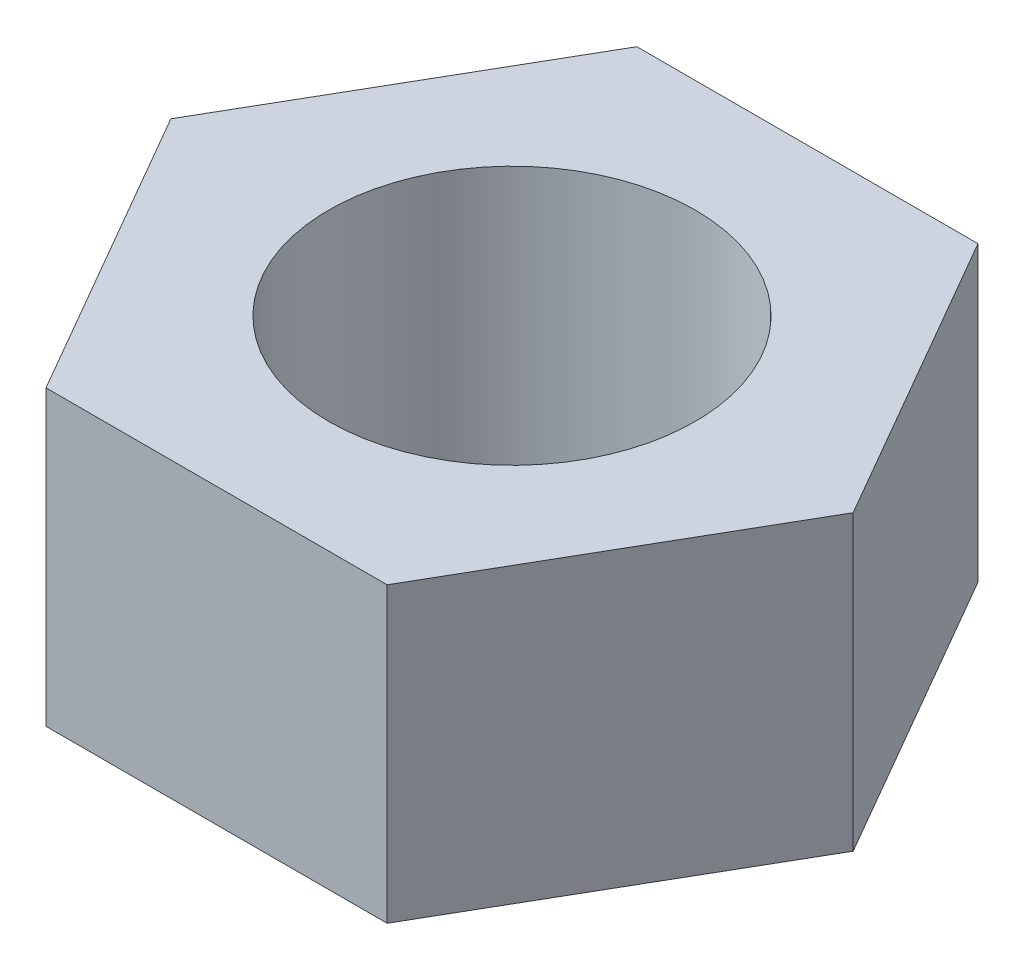
ISO-10303-21;
HEADER;
FILE_DESCRIPTION(('STEP AP214'),'2;1');
FILE_NAME('part.step','',(''),(''),'','','');
FILE_SCHEMA(('AUTOMOTIVE_DESIGN { 1 0 10303 214 1 1 1 1 }'));
ENDSEC;
DATA;
#1=APPLICATION_CONTEXT('core data for automotive mechanical design processes');
#2=APPLICATION_PROTOCOL_DEFINITION('international standard','automotive_design',2000,#1);
#3=PRODUCT_CONTEXT('',#1,'mechanical');
#4=PRODUCT('Part','Part','',(#3));
#5=PRODUCT_RELATED_PRODUCT_CATEGORY('part','',(#4));
#6=PRODUCT_DEFINITION_FORMATION('','',#4);
#7=PRODUCT_DEFINITION_CONTEXT('part definition',#1,'design');
#8=PRODUCT_DEFINITION('design','',#6,#7);
#9=PRODUCT_DEFINITION_SHAPE('','',#8);
#10=(LENGTH_UNIT() NAMED_UNIT(*) SI_UNIT(.MILLI.,.METRE.));
#11=(NAMED_UNIT(*) PLANE_ANGLE_UNIT() SI_UNIT($,.RADIAN.));
#12=(NAMED_UNIT(*) SI_UNIT($,.STERADIAN.) SOLID_ANGLE_UNIT());
#13=UNCERTAINTY_MEASURE_WITH_UNIT(LENGTH_MEASURE(1.E-05),#10,'distance_accuracy_value','');
#14=(GEOMETRIC_REPRESENTATION_CONTEXT(3) GLOBAL_UNCERTAINTY_ASSIGNED_CONTEXT((#13)) GLOBAL_UNIT_ASSIGNED_CONTEXT((#10,
#11,#12)) REPRESENTATION_CONTEXT('',''));
#15=CARTESIAN_POINT('',(0.,0.,0.));
#16=DIRECTION('',(0.,0.,1.));
#17=DIRECTION('',(1.,0.,0.));
#18=AXIS2_PLACEMENT_3D('',#15,#16,#17);
#19=CARTESIAN_POINT('',(0.,6.4,0.));
#20=DIRECTION('',(0.,1.,0.));
#21=DIRECTION('',(0.,0.,1.));
#22=AXIS2_PLACEMENT_3D('',#19,#20,#21);
#23=PLANE('',#22);
#24=DIRECTION('',(-0.5,0.,-0.866025403784439));
#25=VECTOR('',#24,1.);
#26=CARTESIAN_POINT('',(7.44781847254618,6.4,0.));
#27=LINE('',#26,#25);
#28=CARTESIAN_POINT('',(7.44781847254618,6.4,0.));
#29=VERTEX_POINT('',#28);
#30=CARTESIAN_POINT('',(3.72390923627309,6.4,-6.45));
#31=VERTEX_POINT('',#30);
#32=EDGE_CURVE('E146',#29,#31,#27,.T.);
#33=ORIENTED_EDGE('',*,*,#32,.T.);
#34=DIRECTION('',(-1.,0.,0.));
#35=VECTOR('',#34,1.);
#36=CARTESIAN_POINT('',(3.72390923627309,6.4,-6.45));
#37=LINE('',#36,#35);
#38=CARTESIAN_POINT('',(-3.72390923627309,6.4,-6.45));
#39=VERTEX_POINT('',#38);
#40=EDGE_CURVE('E94',#31,#39,#37,.T.);
#41=ORIENTED_EDGE('',*,*,#40,.T.);
#42=DIRECTION('',(-0.5,0.,0.866025403784439));
#43=VECTOR('',#42,1.);
#44=CARTESIAN_POINT('',(-3.72390923627309,6.4,-6.45));
#45=LINE('',#44,#43);
#46=CARTESIAN_POINT('',(-7.44781847254617,6.4,0.));
#47=VERTEX_POINT('',#46);
#48=EDGE_CURVE('E107',#39,#47,#45,.T.);
#49=ORIENTED_EDGE('',*,*,#48,.T.);
#50=DIRECTION('',(0.5,0.,0.866025403784439));
#51=VECTOR('',#50,1.);
#52=CARTESIAN_POINT('',(-7.44781847254617,6.4,0.));
#53=LINE('',#52,#51);
#54=CARTESIAN_POINT('',(-3.72390923627309,6.4,6.45));
#55=VERTEX_POINT('',#54);
#56=EDGE_CURVE('E101',#47,#55,#53,.T.);
#57=ORIENTED_EDGE('',*,*,#56,.T.);
#58=DIRECTION('',(1.,0.,0.));
#59=VECTOR('',#58,1.);
#60=CARTESIAN_POINT('',(-3.72390923627309,6.4,6.45));
#61=LINE('',#60,#59);
#62=CARTESIAN_POINT('',(3.72390923627309,6.4,6.45));
#63=VERTEX_POINT('',#62);
#64=EDGE_CURVE('E105',#55,#63,#61,.T.);
#65=ORIENTED_EDGE('',*,*,#64,.T.);
#66=DIRECTION('',(0.5,0.,-0.866025403784439));
#67=VECTOR('',#66,1.);
#68=CARTESIAN_POINT('',(3.72390923627309,6.4,6.45));
#69=LINE('',#68,#67);
#70=EDGE_CURVE('E57',#63,#29,#69,.T.);
#71=ORIENTED_EDGE('',*,*,#70,.T.);
#72=EDGE_LOOP('',(#33,#41,#49,#57,#65,#71));
#73=FACE_BOUND('',#72,.T.);
#74=CARTESIAN_POINT('',(0.,6.4,0.));
#75=DIRECTION('',(0.,1.,0.));
#76=DIRECTION('',(0.,0.,1.));
#77=AXIS2_PLACEMENT_3D('',#74,#75,#76);
#78=CIRCLE('',#77,4.);
#79=CARTESIAN_POINT('',(0.,6.4,4.));
#80=VERTEX_POINT('',#79);
#81=EDGE_CURVE('E134',#80,#80,#78,.T.);
#82=ORIENTED_EDGE('',*,*,#81,.F.);
#83=EDGE_LOOP('',(#82));
#84=FACE_BOUND('',#83,.T.);
#85=ADVANCED_FACE('F39',(#73,#84),#23,.T.);
#86=CARTESIAN_POINT('',(0.,0.,0.));
#87=DIRECTION('',(0.,1.,0.));
#88=DIRECTION('',(0.,0.,1.));
#89=AXIS2_PLACEMENT_3D('',#86,#87,#88);
#90=PLANE('',#89);
#91=DIRECTION('',(-0.5,0.,-0.866025403784439));
#92=VECTOR('',#91,1.);
#93=CARTESIAN_POINT('',(7.44781847254618,0.,0.));
#94=LINE('',#93,#92);
#95=CARTESIAN_POINT('',(7.44781847254618,0.,0.));
#96=VERTEX_POINT('',#95);
#97=CARTESIAN_POINT('',(3.72390923627309,0.,-6.45));
#98=VERTEX_POINT('',#97);
#99=EDGE_CURVE('E129',#96,#98,#94,.T.);
#100=ORIENTED_EDGE('',*,*,#99,.F.);
#101=DIRECTION('',(0.5,0.,-0.866025403784439));
#102=VECTOR('',#101,1.);
#103=CARTESIAN_POINT('',(3.72390923627309,0.,6.45));
#104=LINE('',#103,#102);
#105=CARTESIAN_POINT('',(3.72390923627309,0.,6.45));
#106=VERTEX_POINT('',#105);
#107=EDGE_CURVE('E86',#106,#96,#104,.T.);
#108=ORIENTED_EDGE('',*,*,#107,.F.);
#109=DIRECTION('',(1.,0.,0.));
#110=VECTOR('',#109,1.);
#111=CARTESIAN_POINT('',(-3.72390923627309,0.,6.45));
#112=LINE('',#111,#110);
#113=CARTESIAN_POINT('',(-3.72390923627309,0.,6.45));
#114=VERTEX_POINT('',#113);
#115=EDGE_CURVE('E80',#114,#106,#112,.T.);
#116=ORIENTED_EDGE('',*,*,#115,.F.);
#117=DIRECTION('',(0.5,0.,0.866025403784439));
#118=VECTOR('',#117,1.);
#119=CARTESIAN_POINT('',(-7.44781847254617,0.,0.));
#120=LINE('',#119,#118);
#121=CARTESIAN_POINT('',(-7.44781847254617,0.,0.));
#122=VERTEX_POINT('',#121);
#123=EDGE_CURVE('E116',#122,#114,#120,.T.);
#124=ORIENTED_EDGE('',*,*,#123,.F.);
#125=DIRECTION('',(-0.5,0.,0.866025403784439));
#126=VECTOR('',#125,1.);
#127=CARTESIAN_POINT('',(-3.72390923627309,0.,-6.45));
#128=LINE('',#127,#126);
#129=CARTESIAN_POINT('',(-3.72390923627309,0.,-6.45));
#130=VERTEX_POINT('',#129);
#131=EDGE_CURVE('E137',#130,#122,#128,.T.);
#132=ORIENTED_EDGE('',*,*,#131,.F.);
#133=DIRECTION('',(-1.,0.,0.));
#134=VECTOR('',#133,1.);
#135=CARTESIAN_POINT('',(3.72390923627309,0.,-6.45));
#136=LINE('',#135,#134);
#137=EDGE_CURVE('E133',#98,#130,#136,.T.);
#138=ORIENTED_EDGE('',*,*,#137,.F.);
#139=EDGE_LOOP('',(#100,#108,#116,#124,#132,#138));
#140=FACE_BOUND('',#139,.T.);
#141=CARTESIAN_POINT('',(0.,0.,0.));
#142=DIRECTION('',(0.,1.,0.));
#143=DIRECTION('',(0.,0.,1.));
#144=AXIS2_PLACEMENT_3D('',#141,#142,#143);
#145=CIRCLE('',#144,4.);
#146=CARTESIAN_POINT('',(0.,0.,4.));
#147=VERTEX_POINT('',#146);
#148=EDGE_CURVE('E243',#147,#147,#145,.T.);
#149=ORIENTED_EDGE('',*,*,#148,.T.);
#150=EDGE_LOOP('',(#149));
#151=FACE_BOUND('',#150,.T.);
#152=ADVANCED_FACE('F159',(#140,#151),#90,.F.);
#153=CARTESIAN_POINT('',(7.44781847254618,6.4,0.));
#154=DIRECTION('',(-0.866025403784439,0.,0.5));
#155=DIRECTION('',(0.5,0.,0.866025403784439));
#156=AXIS2_PLACEMENT_3D('',#153,#154,#155);
#157=PLANE('',#156);
#158=ORIENTED_EDGE('',*,*,#99,.T.);
#159=DIRECTION('',(0.,-1.,0.));
#160=VECTOR('',#159,1.);
#161=CARTESIAN_POINT('',(3.72390923627309,6.4,-6.45));
#162=LINE('',#161,#160);
#163=EDGE_CURVE('E11',#31,#98,#162,.T.);
#164=ORIENTED_EDGE('',*,*,#163,.F.);
#165=ORIENTED_EDGE('',*,*,#32,.F.);
#166=DIRECTION('',(0.,-1.,0.));
#167=VECTOR('',#166,1.);
#168=CARTESIAN_POINT('',(7.44781847254618,6.4,0.));
#169=LINE('',#168,#167);
#170=EDGE_CURVE('E125',#29,#96,#169,.T.);
#171=ORIENTED_EDGE('',*,*,#170,.T.);
#172=EDGE_LOOP('',(#158,#164,#165,#171));
#173=FACE_BOUND('',#172,.T.);
#174=ADVANCED_FACE('F41',(#173),#157,.F.);
#175=CARTESIAN_POINT('',(3.72390923627309,6.4,-6.45));
#176=DIRECTION('',(0.,0.,1.));
#177=DIRECTION('',(1.,0.,0.));
#178=AXIS2_PLACEMENT_3D('',#175,#176,#177);
#179=PLANE('',#178);
#180=ORIENTED_EDGE('',*,*,#137,.T.);
#181=DIRECTION('',(0.,-1.,0.));
#182=VECTOR('',#181,1.);
#183=CARTESIAN_POINT('',(-3.72390923627309,6.4,-6.45));
#184=LINE('',#183,#182);
#185=EDGE_CURVE('E49',#39,#130,#184,.T.);
#186=ORIENTED_EDGE('',*,*,#185,.F.);
#187=ORIENTED_EDGE('',*,*,#40,.F.);
#188=ORIENTED_EDGE('',*,*,#163,.T.);
#189=EDGE_LOOP('',(#180,#186,#187,#188));
#190=FACE_BOUND('',#189,.T.);
#191=ADVANCED_FACE('F184',(#190),#179,.F.);
#192=CARTESIAN_POINT('',(-3.72390923627309,6.4,-6.45));
#193=DIRECTION('',(0.866025403784439,0.,0.5));
#194=DIRECTION('',(0.5,0.,-0.866025403784439));
#195=AXIS2_PLACEMENT_3D('',#192,#193,#194);
#196=PLANE('',#195);
#197=ORIENTED_EDGE('',*,*,#131,.T.);
#198=DIRECTION('',(0.,-1.,0.));
#199=VECTOR('',#198,1.);
#200=CARTESIAN_POINT('',(-7.44781847254617,6.4,0.));
#201=LINE('',#200,#199);
#202=EDGE_CURVE('E118',#47,#122,#201,.T.);
#203=ORIENTED_EDGE('',*,*,#202,.F.);
#204=ORIENTED_EDGE('',*,*,#48,.F.);
#205=ORIENTED_EDGE('',*,*,#185,.T.);
#206=EDGE_LOOP('',(#197,#203,#204,#205));
#207=FACE_BOUND('',#206,.T.);
#208=ADVANCED_FACE('F156',(#207),#196,.F.);
#209=CARTESIAN_POINT('',(-7.44781847254617,6.4,0.));
#210=DIRECTION('',(0.866025403784439,0.,-0.5));
#211=DIRECTION('',(-0.5,0.,-0.866025403784439));
#212=AXIS2_PLACEMENT_3D('',#209,#210,#211);
#213=PLANE('',#212);
#214=ORIENTED_EDGE('',*,*,#123,.T.);
#215=DIRECTION('',(0.,-1.,0.));
#216=VECTOR('',#215,1.);
#217=CARTESIAN_POINT('',(-3.72390923627309,6.4,6.45));
#218=LINE('',#217,#216);
#219=EDGE_CURVE('E113',#55,#114,#218,.T.);
#220=ORIENTED_EDGE('',*,*,#219,.F.);
#221=ORIENTED_EDGE('',*,*,#56,.F.);
#222=ORIENTED_EDGE('',*,*,#202,.T.);
#223=EDGE_LOOP('',(#214,#220,#221,#222));
#224=FACE_BOUND('',#223,.T.);
#225=ADVANCED_FACE('F114',(#224),#213,.F.);
#226=CARTESIAN_POINT('',(-3.72390923627309,6.4,6.45));
#227=DIRECTION('',(0.,0.,-1.));
#228=DIRECTION('',(-1.,0.,0.));
#229=AXIS2_PLACEMENT_3D('',#226,#227,#228);
#230=PLANE('',#229);
#231=ORIENTED_EDGE('',*,*,#115,.T.);
#232=DIRECTION('',(0.,-1.,0.));
#233=VECTOR('',#232,1.);
#234=CARTESIAN_POINT('',(3.72390923627309,6.4,6.45));
#235=LINE('',#234,#233);
#236=EDGE_CURVE('E119',#63,#106,#235,.T.);
#237=ORIENTED_EDGE('',*,*,#236,.F.);
#238=ORIENTED_EDGE('',*,*,#64,.F.);
#239=ORIENTED_EDGE('',*,*,#219,.T.);
#240=EDGE_LOOP('',(#231,#237,#238,#239));
#241=FACE_BOUND('',#240,.T.);
#242=ADVANCED_FACE('F121',(#241),#230,.F.);
#243=CARTESIAN_POINT('',(3.72390923627309,6.4,6.45));
#244=DIRECTION('',(-0.866025403784439,0.,-0.5));
#245=DIRECTION('',(-0.5,0.,0.866025403784439));
#246=AXIS2_PLACEMENT_3D('',#243,#244,#245);
#247=PLANE('',#246);
#248=ORIENTED_EDGE('',*,*,#107,.T.);
#249=ORIENTED_EDGE('',*,*,#170,.F.);
#250=ORIENTED_EDGE('',*,*,#70,.F.);
#251=ORIENTED_EDGE('',*,*,#236,.T.);
#252=EDGE_LOOP('',(#248,#249,#250,#251));
#253=FACE_BOUND('',#252,.T.);
#254=ADVANCED_FACE('F164',(#253),#247,.F.);
#255=CARTESIAN_POINT('',(0.,6.4,0.));
#256=DIRECTION('',(0.,-1.,0.));
#257=DIRECTION('',(0.,0.,-1.));
#258=AXIS2_PLACEMENT_3D('',#255,#256,#257);
#259=CYLINDRICAL_SURFACE('',#258,4.);
#260=ORIENTED_EDGE('',*,*,#81,.T.);
#261=EDGE_LOOP('',(#260));
#262=FACE_BOUND('',#261,.T.);
#263=ORIENTED_EDGE('',*,*,#148,.F.);
#264=EDGE_LOOP('',(#263));
#265=FACE_BOUND('',#264,.T.);
#266=ADVANCED_FACE('F166',(#262,#265),#259,.F.);
#267=CLOSED_SHELL('',(#85,#152,#174,#191,#208,#225,#242,#254,#266));
#268=MANIFOLD_SOLID_BREP('B2',#267);
#269=ADVANCED_BREP_SHAPE_REPRESENTATION('',(#18,#268),#14);
#270=SHAPE_DEFINITION_REPRESENTATION(#9,#269);
ENDSEC;
END-ISO-10303-21;
